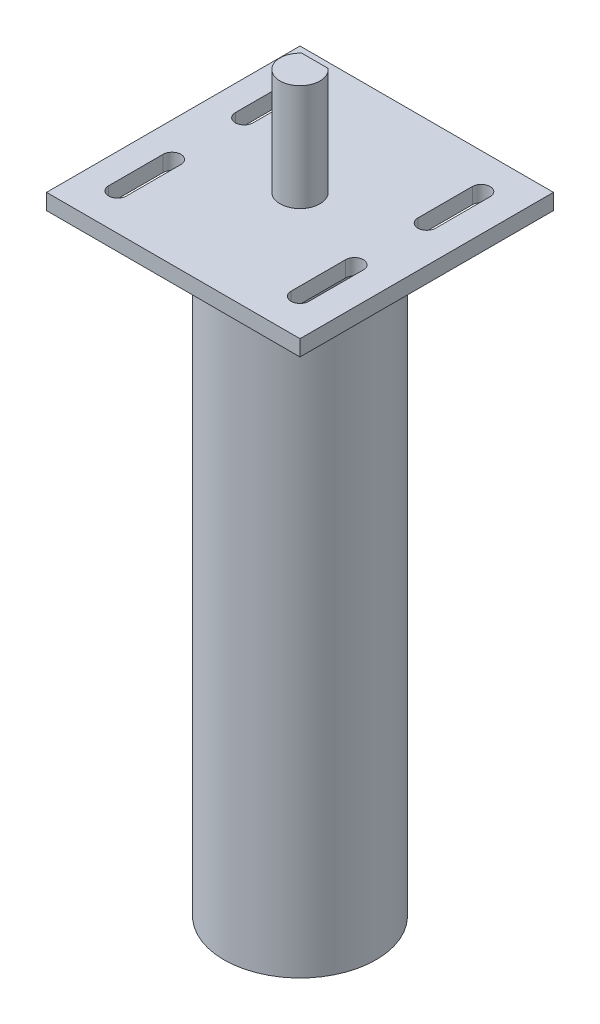
ISO-10303-21;
HEADER;
FILE_DESCRIPTION(('STEP AP214'),'2;1');
FILE_NAME('part.step','',(''),(''),'','','');
FILE_SCHEMA(('AUTOMOTIVE_DESIGN { 1 0 10303 214 1 1 1 1 }'));
ENDSEC;
DATA;
#1=APPLICATION_CONTEXT('core data for automotive mechanical design processes');
#2=APPLICATION_PROTOCOL_DEFINITION('international standard','automotive_design',2000,#1);
#3=PRODUCT_CONTEXT('',#1,'mechanical');
#4=PRODUCT('Part','Part','',(#3));
#5=PRODUCT_RELATED_PRODUCT_CATEGORY('part','',(#4));
#6=PRODUCT_DEFINITION_FORMATION('','',#4);
#7=PRODUCT_DEFINITION_CONTEXT('part definition',#1,'design');
#8=PRODUCT_DEFINITION('design','',#6,#7);
#9=PRODUCT_DEFINITION_SHAPE('','',#8);
#10=(LENGTH_UNIT() NAMED_UNIT(*) SI_UNIT(.MILLI.,.METRE.));
#11=(NAMED_UNIT(*) PLANE_ANGLE_UNIT() SI_UNIT($,.RADIAN.));
#12=(NAMED_UNIT(*) SI_UNIT($,.STERADIAN.) SOLID_ANGLE_UNIT());
#13=UNCERTAINTY_MEASURE_WITH_UNIT(LENGTH_MEASURE(1.E-05),#10,'distance_accuracy_value','');
#14=(GEOMETRIC_REPRESENTATION_CONTEXT(3) GLOBAL_UNCERTAINTY_ASSIGNED_CONTEXT((#13)) GLOBAL_UNIT_ASSIGNED_CONTEXT((#10,
#11,#12)) REPRESENTATION_CONTEXT('',''));
#15=CARTESIAN_POINT('',(0.,0.,0.));
#16=DIRECTION('',(0.,0.,1.));
#17=DIRECTION('',(1.,0.,0.));
#18=AXIS2_PLACEMENT_3D('',#15,#16,#17);
#19=CARTESIAN_POINT('',(0.,122.428,0.));
#20=DIRECTION('',(0.,-1.,0.));
#21=DIRECTION('',(0.,0.,-1.));
#22=AXIS2_PLACEMENT_3D('',#19,#20,#21);
#23=CYLINDRICAL_SURFACE('',#22,15.24);
#24=CARTESIAN_POINT('',(0.,122.428,0.));
#25=DIRECTION('',(0.,1.,0.));
#26=DIRECTION('',(0.,0.,1.));
#27=AXIS2_PLACEMENT_3D('',#24,#25,#26);
#28=CIRCLE('',#27,15.24);
#29=CARTESIAN_POINT('',(0.,122.428,15.24));
#30=VERTEX_POINT('',#29);
#31=EDGE_CURVE('E11',#30,#30,#28,.T.);
#32=ORIENTED_EDGE('',*,*,#31,.F.);
#33=EDGE_LOOP('',(#32));
#34=FACE_BOUND('',#33,.T.);
#35=CARTESIAN_POINT('',(0.,0.,0.));
#36=DIRECTION('',(0.,1.,0.));
#37=DIRECTION('',(0.,0.,1.));
#38=AXIS2_PLACEMENT_3D('',#35,#36,#37);
#39=CIRCLE('',#38,15.24);
#40=CARTESIAN_POINT('',(0.,0.,15.24));
#41=VERTEX_POINT('',#40);
#42=EDGE_CURVE('E37',#41,#41,#39,.T.);
#43=ORIENTED_EDGE('',*,*,#42,.T.);
#44=EDGE_LOOP('',(#43));
#45=FACE_BOUND('',#44,.T.);
#46=ADVANCED_FACE('F34',(#34,#45),#23,.T.);
#47=CARTESIAN_POINT('',(0.,0.,0.));
#48=DIRECTION('',(0.,1.,0.));
#49=DIRECTION('',(0.,0.,1.));
#50=AXIS2_PLACEMENT_3D('',#47,#48,#49);
#51=PLANE('',#50);
#52=ORIENTED_EDGE('',*,*,#42,.F.);
#53=EDGE_LOOP('',(#52));
#54=FACE_BOUND('',#53,.T.);
#55=ADVANCED_FACE('F355',(#54),#51,.F.);
#56=CARTESIAN_POINT('',(25.4,125.603,-25.4));
#57=DIRECTION('',(-1.,0.,0.));
#58=DIRECTION('',(0.,0.,1.));
#59=AXIS2_PLACEMENT_3D('',#56,#57,#58);
#60=PLANE('',#59);
#61=DIRECTION('',(0.,0.,-1.));
#62=VECTOR('',#61,1.);
#63=CARTESIAN_POINT('',(25.4,122.428,-25.4));
#64=LINE('',#63,#62);
#65=CARTESIAN_POINT('',(25.4,122.428,25.4));
#66=VERTEX_POINT('',#65);
#67=CARTESIAN_POINT('',(25.4,122.428,-25.4));
#68=VERTEX_POINT('',#67);
#69=EDGE_CURVE('E318',#66,#68,#64,.T.);
#70=ORIENTED_EDGE('',*,*,#69,.T.);
#71=DIRECTION('',(0.,-1.,0.));
#72=VECTOR('',#71,1.);
#73=CARTESIAN_POINT('',(25.4,125.603,-25.4));
#74=LINE('',#73,#72);
#75=CARTESIAN_POINT('',(25.4,125.603,-25.4));
#76=VERTEX_POINT('',#75);
#77=EDGE_CURVE('E347',#76,#68,#74,.T.);
#78=ORIENTED_EDGE('',*,*,#77,.F.);
#79=DIRECTION('',(0.,0.,-1.));
#80=VECTOR('',#79,1.);
#81=CARTESIAN_POINT('',(25.4,125.603,-25.4));
#82=LINE('',#81,#80);
#83=CARTESIAN_POINT('',(25.4,125.603,25.4));
#84=VERTEX_POINT('',#83);
#85=EDGE_CURVE('E321',#84,#76,#82,.T.);
#86=ORIENTED_EDGE('',*,*,#85,.F.);
#87=DIRECTION('',(0.,-1.,0.));
#88=VECTOR('',#87,1.);
#89=CARTESIAN_POINT('',(25.4,125.603,25.4));
#90=LINE('',#89,#88);
#91=EDGE_CURVE('E331',#84,#66,#90,.T.);
#92=ORIENTED_EDGE('',*,*,#91,.T.);
#93=EDGE_LOOP('',(#70,#78,#86,#92));
#94=FACE_BOUND('',#93,.T.);
#95=ADVANCED_FACE('F357',(#94),#60,.F.);
#96=CARTESIAN_POINT('',(-25.4,125.603,-25.4));
#97=DIRECTION('',(0.,0.,1.));
#98=DIRECTION('',(1.,0.,0.));
#99=AXIS2_PLACEMENT_3D('',#96,#97,#98);
#100=PLANE('',#99);
#101=DIRECTION('',(-1.,0.,0.));
#102=VECTOR('',#101,1.);
#103=CARTESIAN_POINT('',(-25.4,122.428,-25.4));
#104=LINE('',#103,#102);
#105=CARTESIAN_POINT('',(-25.4,122.428,-25.4));
#106=VERTEX_POINT('',#105);
#107=EDGE_CURVE('E334',#68,#106,#104,.T.);
#108=ORIENTED_EDGE('',*,*,#107,.T.);
#109=DIRECTION('',(0.,-1.,0.));
#110=VECTOR('',#109,1.);
#111=CARTESIAN_POINT('',(-25.4,125.603,-25.4));
#112=LINE('',#111,#110);
#113=CARTESIAN_POINT('',(-25.4,125.603,-25.4));
#114=VERTEX_POINT('',#113);
#115=EDGE_CURVE('E344',#114,#106,#112,.T.);
#116=ORIENTED_EDGE('',*,*,#115,.F.);
#117=DIRECTION('',(-1.,0.,0.));
#118=VECTOR('',#117,1.);
#119=CARTESIAN_POINT('',(-25.4,125.603,-25.4));
#120=LINE('',#119,#118);
#121=EDGE_CURVE('E324',#76,#114,#120,.T.);
#122=ORIENTED_EDGE('',*,*,#121,.F.);
#123=ORIENTED_EDGE('',*,*,#77,.T.);
#124=EDGE_LOOP('',(#108,#116,#122,#123));
#125=FACE_BOUND('',#124,.T.);
#126=ADVANCED_FACE('F362',(#125),#100,.F.);
#127=CARTESIAN_POINT('',(-25.4,125.603,-25.4));
#128=DIRECTION('',(1.,0.,0.));
#129=DIRECTION('',(0.,0.,-1.));
#130=AXIS2_PLACEMENT_3D('',#127,#128,#129);
#131=PLANE('',#130);
#132=DIRECTION('',(0.,0.,1.));
#133=VECTOR('',#132,1.);
#134=CARTESIAN_POINT('',(-25.4,122.428,-25.4));
#135=LINE('',#134,#133);
#136=CARTESIAN_POINT('',(-25.4,122.428,25.4));
#137=VERTEX_POINT('',#136);
#138=EDGE_CURVE('E336',#106,#137,#135,.T.);
#139=ORIENTED_EDGE('',*,*,#138,.T.);
#140=DIRECTION('',(0.,-1.,0.));
#141=VECTOR('',#140,1.);
#142=CARTESIAN_POINT('',(-25.4,125.603,25.4));
#143=LINE('',#142,#141);
#144=CARTESIAN_POINT('',(-25.4,125.603,25.4));
#145=VERTEX_POINT('',#144);
#146=EDGE_CURVE('E341',#145,#137,#143,.T.);
#147=ORIENTED_EDGE('',*,*,#146,.F.);
#148=DIRECTION('',(0.,0.,1.));
#149=VECTOR('',#148,1.);
#150=CARTESIAN_POINT('',(-25.4,125.603,-25.4));
#151=LINE('',#150,#149);
#152=EDGE_CURVE('E327',#114,#145,#151,.T.);
#153=ORIENTED_EDGE('',*,*,#152,.F.);
#154=ORIENTED_EDGE('',*,*,#115,.T.);
#155=EDGE_LOOP('',(#139,#147,#153,#154));
#156=FACE_BOUND('',#155,.T.);
#157=ADVANCED_FACE('F369',(#156),#131,.F.);
#158=CARTESIAN_POINT('',(-25.4,125.603,25.4));
#159=DIRECTION('',(0.,0.,-1.));
#160=DIRECTION('',(-1.,0.,0.));
#161=AXIS2_PLACEMENT_3D('',#158,#159,#160);
#162=PLANE('',#161);
#163=DIRECTION('',(1.,0.,0.));
#164=VECTOR('',#163,1.);
#165=CARTESIAN_POINT('',(-25.4,122.428,25.4));
#166=LINE('',#165,#164);
#167=EDGE_CURVE('E325',#137,#66,#166,.T.);
#168=ORIENTED_EDGE('',*,*,#167,.T.);
#169=ORIENTED_EDGE('',*,*,#91,.F.);
#170=DIRECTION('',(1.,0.,0.));
#171=VECTOR('',#170,1.);
#172=CARTESIAN_POINT('',(-25.4,125.603,25.4));
#173=LINE('',#172,#171);
#174=EDGE_CURVE('E329',#145,#84,#173,.T.);
#175=ORIENTED_EDGE('',*,*,#174,.F.);
#176=ORIENTED_EDGE('',*,*,#146,.T.);
#177=EDGE_LOOP('',(#168,#169,#175,#176));
#178=FACE_BOUND('',#177,.T.);
#179=ADVANCED_FACE('F372',(#178),#162,.F.);
#180=CARTESIAN_POINT('',(0.,125.603,0.));
#181=DIRECTION('',(0.,1.,0.));
#182=DIRECTION('',(0.,0.,1.));
#183=AXIS2_PLACEMENT_3D('',#180,#181,#182);
#184=PLANE('',#183);
#185=CARTESIAN_POINT('',(18.034,125.603,-18.288));
#186=DIRECTION('',(0.,1.,0.));
#187=DIRECTION('',(0.,0.,1.));
#188=AXIS2_PLACEMENT_3D('',#185,#186,#187);
#189=CIRCLE('',#188,1.778);
#190=CARTESIAN_POINT('',(19.812,125.603,-18.288));
#191=VERTEX_POINT('',#190);
#192=CARTESIAN_POINT('',(16.256,125.603,-18.288));
#193=VERTEX_POINT('',#192);
#194=EDGE_CURVE('E48',#191,#193,#189,.T.);
#195=ORIENTED_EDGE('',*,*,#194,.F.);
#196=DIRECTION('',(0.,0.,-1.));
#197=VECTOR('',#196,1.);
#198=CARTESIAN_POINT('',(19.812,125.603,-18.288));
#199=LINE('',#198,#197);
#200=CARTESIAN_POINT('',(19.812,125.603,-7.36599999999999));
#201=VERTEX_POINT('',#200);
#202=EDGE_CURVE('E266',#201,#191,#199,.T.);
#203=ORIENTED_EDGE('',*,*,#202,.F.);
#204=CARTESIAN_POINT('',(18.034,125.603,-7.36599999999999));
#205=DIRECTION('',(0.,1.,0.));
#206=DIRECTION('',(0.,0.,1.));
#207=AXIS2_PLACEMENT_3D('',#204,#205,#206);
#208=CIRCLE('',#207,1.778);
#209=CARTESIAN_POINT('',(16.256,125.603,-7.36599999999999));
#210=VERTEX_POINT('',#209);
#211=EDGE_CURVE('E263',#210,#201,#208,.T.);
#212=ORIENTED_EDGE('',*,*,#211,.F.);
#213=DIRECTION('',(0.,0.,1.));
#214=VECTOR('',#213,1.);
#215=CARTESIAN_POINT('',(16.256,125.603,-18.288));
#216=LINE('',#215,#214);
#217=EDGE_CURVE('E260',#193,#210,#216,.T.);
#218=ORIENTED_EDGE('',*,*,#217,.F.);
#219=EDGE_LOOP('',(#195,#203,#212,#218));
#220=FACE_BOUND('',#219,.T.);
#221=CARTESIAN_POINT('',(18.034,125.603,7.11200000000001));
#222=DIRECTION('',(0.,1.,0.));
#223=DIRECTION('',(0.,0.,1.));
#224=AXIS2_PLACEMENT_3D('',#221,#222,#223);
#225=CIRCLE('',#224,1.778);
#226=CARTESIAN_POINT('',(19.812,125.603,7.11200000000001));
#227=VERTEX_POINT('',#226);
#228=CARTESIAN_POINT('',(16.256,125.603,7.11200000000001));
#229=VERTEX_POINT('',#228);
#230=EDGE_CURVE('E56',#227,#229,#225,.T.);
#231=ORIENTED_EDGE('',*,*,#230,.F.);
#232=DIRECTION('',(0.,0.,-1.));
#233=VECTOR('',#232,1.);
#234=CARTESIAN_POINT('',(19.812,125.603,7.11200000000001));
#235=LINE('',#234,#233);
#236=CARTESIAN_POINT('',(19.812,125.603,18.034));
#237=VERTEX_POINT('',#236);
#238=EDGE_CURVE('E240',#237,#227,#235,.T.);
#239=ORIENTED_EDGE('',*,*,#238,.F.);
#240=CARTESIAN_POINT('',(18.034,125.603,18.034));
#241=DIRECTION('',(0.,1.,0.));
#242=DIRECTION('',(0.,0.,1.));
#243=AXIS2_PLACEMENT_3D('',#240,#241,#242);
#244=CIRCLE('',#243,1.778);
#245=CARTESIAN_POINT('',(16.256,125.603,18.034));
#246=VERTEX_POINT('',#245);
#247=EDGE_CURVE('E237',#246,#237,#244,.T.);
#248=ORIENTED_EDGE('',*,*,#247,.F.);
#249=DIRECTION('',(0.,0.,1.));
#250=VECTOR('',#249,1.);
#251=CARTESIAN_POINT('',(16.256,125.603,7.11200000000001));
#252=LINE('',#251,#250);
#253=EDGE_CURVE('E233',#229,#246,#252,.T.);
#254=ORIENTED_EDGE('',*,*,#253,.F.);
#255=EDGE_LOOP('',(#231,#239,#248,#254));
#256=FACE_BOUND('',#255,.T.);
#257=CARTESIAN_POINT('',(-18.542,125.603,7.112));
#258=DIRECTION('',(0.,1.,0.));
#259=DIRECTION('',(0.,0.,1.));
#260=AXIS2_PLACEMENT_3D('',#257,#258,#259);
#261=CIRCLE('',#260,1.778);
#262=CARTESIAN_POINT('',(-16.764,125.603,7.112));
#263=VERTEX_POINT('',#262);
#264=CARTESIAN_POINT('',(-20.32,125.603,7.112));
#265=VERTEX_POINT('',#264);
#266=EDGE_CURVE('E205',#263,#265,#261,.T.);
#267=ORIENTED_EDGE('',*,*,#266,.F.);
#268=DIRECTION('',(0.,0.,-1.));
#269=VECTOR('',#268,1.);
#270=CARTESIAN_POINT('',(-16.764,125.603,7.112));
#271=LINE('',#270,#269);
#272=CARTESIAN_POINT('',(-16.764,125.603,18.034));
#273=VERTEX_POINT('',#272);
#274=EDGE_CURVE('E210',#273,#263,#271,.T.);
#275=ORIENTED_EDGE('',*,*,#274,.F.);
#276=CARTESIAN_POINT('',(-18.542,125.603,18.034));
#277=DIRECTION('',(0.,1.,0.));
#278=DIRECTION('',(0.,0.,1.));
#279=AXIS2_PLACEMENT_3D('',#276,#277,#278);
#280=CIRCLE('',#279,1.778);
#281=CARTESIAN_POINT('',(-20.32,125.603,18.034));
#282=VERTEX_POINT('',#281);
#283=EDGE_CURVE('E189',#282,#273,#280,.T.);
#284=ORIENTED_EDGE('',*,*,#283,.F.);
#285=DIRECTION('',(0.,0.,1.));
#286=VECTOR('',#285,1.);
#287=CARTESIAN_POINT('',(-20.32,125.603,7.112));
#288=LINE('',#287,#286);
#289=EDGE_CURVE('E200',#265,#282,#288,.T.);
#290=ORIENTED_EDGE('',*,*,#289,.F.);
#291=EDGE_LOOP('',(#267,#275,#284,#290));
#292=FACE_BOUND('',#291,.T.);
#293=CARTESIAN_POINT('',(-18.542,125.603,-18.288));
#294=DIRECTION('',(0.,1.,0.));
#295=DIRECTION('',(0.,0.,1.));
#296=AXIS2_PLACEMENT_3D('',#293,#294,#295);
#297=CIRCLE('',#296,1.778);
#298=CARTESIAN_POINT('',(-16.764,125.603,-18.288));
#299=VERTEX_POINT('',#298);
#300=CARTESIAN_POINT('',(-20.32,125.603,-18.288));
#301=VERTEX_POINT('',#300);
#302=EDGE_CURVE('E221',#299,#301,#297,.T.);
#303=ORIENTED_EDGE('',*,*,#302,.F.);
#304=DIRECTION('',(0.,0.,-1.));
#305=VECTOR('',#304,1.);
#306=CARTESIAN_POINT('',(-16.764,125.603,-18.288));
#307=LINE('',#306,#305);
#308=CARTESIAN_POINT('',(-16.764,125.603,-7.366));
#309=VERTEX_POINT('',#308);
#310=EDGE_CURVE('E293',#309,#299,#307,.T.);
#311=ORIENTED_EDGE('',*,*,#310,.F.);
#312=CARTESIAN_POINT('',(-18.542,125.603,-7.366));
#313=DIRECTION('',(0.,1.,0.));
#314=DIRECTION('',(0.,0.,1.));
#315=AXIS2_PLACEMENT_3D('',#312,#313,#314);
#316=CIRCLE('',#315,1.778);
#317=CARTESIAN_POINT('',(-20.32,125.603,-7.366));
#318=VERTEX_POINT('',#317);
#319=EDGE_CURVE('E290',#318,#309,#316,.T.);
#320=ORIENTED_EDGE('',*,*,#319,.F.);
#321=DIRECTION('',(0.,0.,1.));
#322=VECTOR('',#321,1.);
#323=CARTESIAN_POINT('',(-20.32,125.603,-18.288));
#324=LINE('',#323,#322);
#325=EDGE_CURVE('E287',#301,#318,#324,.T.);
#326=ORIENTED_EDGE('',*,*,#325,.F.);
#327=EDGE_LOOP('',(#303,#311,#320,#326));
#328=FACE_BOUND('',#327,.T.);
#329=CARTESIAN_POINT('',(0.,125.603,0.));
#330=DIRECTION('',(0.,1.,0.));
#331=DIRECTION('',(0.,0.,1.));
#332=AXIS2_PLACEMENT_3D('',#329,#330,#331);
#333=CIRCLE('',#332,4.);
#334=CARTESIAN_POINT('',(-2.64575131106459,125.603,-3.));
#335=VERTEX_POINT('',#334);
#336=CARTESIAN_POINT('',(2.64575131106459,125.603,-3.));
#337=VERTEX_POINT('',#336);
#338=EDGE_CURVE('E314',#335,#337,#333,.T.);
#339=ORIENTED_EDGE('',*,*,#338,.F.);
#340=DIRECTION('',(-1.,0.,0.));
#341=VECTOR('',#340,1.);
#342=CARTESIAN_POINT('',(2.64575131106459,125.603,-3.));
#343=LINE('',#342,#341);
#344=EDGE_CURVE('E311',#337,#335,#343,.T.);
#345=ORIENTED_EDGE('',*,*,#344,.F.);
#346=EDGE_LOOP('',(#339,#345));
#347=FACE_BOUND('',#346,.T.);
#348=ORIENTED_EDGE('',*,*,#85,.T.);
#349=ORIENTED_EDGE('',*,*,#121,.T.);
#350=ORIENTED_EDGE('',*,*,#152,.T.);
#351=ORIENTED_EDGE('',*,*,#174,.T.);
#352=EDGE_LOOP('',(#348,#349,#350,#351));
#353=FACE_BOUND('',#352,.T.);
#354=ADVANCED_FACE('F207',(#220,#256,#292,#328,#347,#353),#184,.T.);
#355=CARTESIAN_POINT('',(0.,122.428,0.));
#356=DIRECTION('',(0.,1.,0.));
#357=DIRECTION('',(0.,0.,1.));
#358=AXIS2_PLACEMENT_3D('',#355,#356,#357);
#359=PLANE('',#358);
#360=DIRECTION('',(0.,0.,1.));
#361=VECTOR('',#360,1.);
#362=CARTESIAN_POINT('',(19.812,122.428,-18.288));
#363=LINE('',#362,#361);
#364=CARTESIAN_POINT('',(19.812,122.428,-18.288));
#365=VERTEX_POINT('',#364);
#366=CARTESIAN_POINT('',(19.812,122.428,-7.36599999999999));
#367=VERTEX_POINT('',#366);
#368=EDGE_CURVE('E254',#365,#367,#363,.T.);
#369=ORIENTED_EDGE('',*,*,#368,.F.);
#370=CARTESIAN_POINT('',(18.034,122.428,-18.288));
#371=DIRECTION('',(0.,1.,0.));
#372=DIRECTION('',(0.,0.,1.));
#373=AXIS2_PLACEMENT_3D('',#370,#371,#372);
#374=CIRCLE('',#373,1.778);
#375=CARTESIAN_POINT('',(16.256,122.428,-18.288));
#376=VERTEX_POINT('',#375);
#377=EDGE_CURVE('E257',#376,#365,#374,.F.);
#378=ORIENTED_EDGE('',*,*,#377,.F.);
#379=DIRECTION('',(0.,0.,-1.));
#380=VECTOR('',#379,1.);
#381=CARTESIAN_POINT('',(16.256,122.428,-18.288));
#382=LINE('',#381,#380);
#383=CARTESIAN_POINT('',(16.256,122.428,-7.36599999999999));
#384=VERTEX_POINT('',#383);
#385=EDGE_CURVE('E234',#384,#376,#382,.T.);
#386=ORIENTED_EDGE('',*,*,#385,.F.);
#387=CARTESIAN_POINT('',(18.034,122.428,-7.36599999999999));
#388=DIRECTION('',(0.,1.,0.));
#389=DIRECTION('',(0.,0.,1.));
#390=AXIS2_PLACEMENT_3D('',#387,#388,#389);
#391=CIRCLE('',#390,1.778);
#392=EDGE_CURVE('E251',#367,#384,#391,.F.);
#393=ORIENTED_EDGE('',*,*,#392,.F.);
#394=EDGE_LOOP('',(#369,#378,#386,#393));
#395=FACE_BOUND('',#394,.T.);
#396=DIRECTION('',(0.,0.,1.));
#397=VECTOR('',#396,1.);
#398=CARTESIAN_POINT('',(19.812,122.428,7.11200000000001));
#399=LINE('',#398,#397);
#400=CARTESIAN_POINT('',(19.812,122.428,7.11200000000001));
#401=VERTEX_POINT('',#400);
#402=CARTESIAN_POINT('',(19.812,122.428,18.034));
#403=VERTEX_POINT('',#402);
#404=EDGE_CURVE('E226',#401,#403,#399,.T.);
#405=ORIENTED_EDGE('',*,*,#404,.F.);
#406=CARTESIAN_POINT('',(18.034,122.428,7.11200000000001));
#407=DIRECTION('',(0.,1.,0.));
#408=DIRECTION('',(0.,0.,1.));
#409=AXIS2_PLACEMENT_3D('',#406,#407,#408);
#410=CIRCLE('',#409,1.778);
#411=CARTESIAN_POINT('',(16.256,122.428,7.11200000000001));
#412=VERTEX_POINT('',#411);
#413=EDGE_CURVE('E229',#412,#401,#410,.F.);
#414=ORIENTED_EDGE('',*,*,#413,.F.);
#415=DIRECTION('',(0.,0.,-1.));
#416=VECTOR('',#415,1.);
#417=CARTESIAN_POINT('',(16.256,122.428,7.11200000000001));
#418=LINE('',#417,#416);
#419=CARTESIAN_POINT('',(16.256,122.428,18.034));
#420=VERTEX_POINT('',#419);
#421=EDGE_CURVE('E231',#420,#412,#418,.T.);
#422=ORIENTED_EDGE('',*,*,#421,.F.);
#423=CARTESIAN_POINT('',(18.034,122.428,18.034));
#424=DIRECTION('',(0.,1.,0.));
#425=DIRECTION('',(0.,0.,1.));
#426=AXIS2_PLACEMENT_3D('',#423,#424,#425);
#427=CIRCLE('',#426,1.778);
#428=EDGE_CURVE('E223',#403,#420,#427,.F.);
#429=ORIENTED_EDGE('',*,*,#428,.F.);
#430=EDGE_LOOP('',(#405,#414,#422,#429));
#431=FACE_BOUND('',#430,.T.);
#432=DIRECTION('',(0.,0.,1.));
#433=VECTOR('',#432,1.);
#434=CARTESIAN_POINT('',(-16.764,122.428,7.112));
#435=LINE('',#434,#433);
#436=CARTESIAN_POINT('',(-16.764,122.428,7.112));
#437=VERTEX_POINT('',#436);
#438=CARTESIAN_POINT('',(-16.764,122.428,18.034));
#439=VERTEX_POINT('',#438);
#440=EDGE_CURVE('E457',#437,#439,#435,.T.);
#441=ORIENTED_EDGE('',*,*,#440,.F.);
#442=CARTESIAN_POINT('',(-18.542,122.428,7.112));
#443=DIRECTION('',(0.,1.,0.));
#444=DIRECTION('',(0.,0.,1.));
#445=AXIS2_PLACEMENT_3D('',#442,#443,#444);
#446=CIRCLE('',#445,1.778);
#447=CARTESIAN_POINT('',(-20.32,122.428,7.112));
#448=VERTEX_POINT('',#447);
#449=EDGE_CURVE('E222',#448,#437,#446,.F.);
#450=ORIENTED_EDGE('',*,*,#449,.F.);
#451=DIRECTION('',(0.,0.,-1.));
#452=VECTOR('',#451,1.);
#453=CARTESIAN_POINT('',(-20.32,122.428,7.112));
#454=LINE('',#453,#452);
#455=CARTESIAN_POINT('',(-20.32,122.428,18.034));
#456=VERTEX_POINT('',#455);
#457=EDGE_CURVE('E219',#456,#448,#454,.T.);
#458=ORIENTED_EDGE('',*,*,#457,.F.);
#459=CARTESIAN_POINT('',(-18.542,122.428,18.034));
#460=DIRECTION('',(0.,1.,0.));
#461=DIRECTION('',(0.,0.,1.));
#462=AXIS2_PLACEMENT_3D('',#459,#460,#461);
#463=CIRCLE('',#462,1.778);
#464=EDGE_CURVE('E192',#439,#456,#463,.F.);
#465=ORIENTED_EDGE('',*,*,#464,.F.);
#466=EDGE_LOOP('',(#441,#450,#458,#465));
#467=FACE_BOUND('',#466,.T.);
#468=DIRECTION('',(0.,0.,1.));
#469=VECTOR('',#468,1.);
#470=CARTESIAN_POINT('',(-16.764,122.428,-18.288));
#471=LINE('',#470,#469);
#472=CARTESIAN_POINT('',(-16.764,122.428,-18.288));
#473=VERTEX_POINT('',#472);
#474=CARTESIAN_POINT('',(-16.764,122.428,-7.366));
#475=VERTEX_POINT('',#474);
#476=EDGE_CURVE('E280',#473,#475,#471,.T.);
#477=ORIENTED_EDGE('',*,*,#476,.F.);
#478=CARTESIAN_POINT('',(-18.542,122.428,-18.288));
#479=DIRECTION('',(0.,1.,0.));
#480=DIRECTION('',(0.,0.,1.));
#481=AXIS2_PLACEMENT_3D('',#478,#479,#480);
#482=CIRCLE('',#481,1.778);
#483=CARTESIAN_POINT('',(-20.32,122.428,-18.288));
#484=VERTEX_POINT('',#483);
#485=EDGE_CURVE('E283',#484,#473,#482,.F.);
#486=ORIENTED_EDGE('',*,*,#485,.F.);
#487=DIRECTION('',(0.,0.,-1.));
#488=VECTOR('',#487,1.);
#489=CARTESIAN_POINT('',(-20.32,122.428,-18.288));
#490=LINE('',#489,#488);
#491=CARTESIAN_POINT('',(-20.32,122.428,-7.366));
#492=VERTEX_POINT('',#491);
#493=EDGE_CURVE('E285',#492,#484,#490,.T.);
#494=ORIENTED_EDGE('',*,*,#493,.F.);
#495=CARTESIAN_POINT('',(-18.542,122.428,-7.366));
#496=DIRECTION('',(0.,1.,0.));
#497=DIRECTION('',(0.,0.,1.));
#498=AXIS2_PLACEMENT_3D('',#495,#496,#497);
#499=CIRCLE('',#498,1.778);
#500=EDGE_CURVE('E277',#475,#492,#499,.F.);
#501=ORIENTED_EDGE('',*,*,#500,.F.);
#502=EDGE_LOOP('',(#477,#486,#494,#501));
#503=FACE_BOUND('',#502,.T.);
#504=ORIENTED_EDGE('',*,*,#31,.T.);
#505=EDGE_LOOP('',(#504));
#506=FACE_BOUND('',#505,.T.);
#507=ORIENTED_EDGE('',*,*,#69,.F.);
#508=ORIENTED_EDGE('',*,*,#167,.F.);
#509=ORIENTED_EDGE('',*,*,#138,.F.);
#510=ORIENTED_EDGE('',*,*,#107,.F.);
#511=EDGE_LOOP('',(#507,#508,#509,#510));
#512=FACE_BOUND('',#511,.T.);
#513=ADVANCED_FACE('F377',(#395,#431,#467,#503,#506,#512),#359,.F.);
#514=CARTESIAN_POINT('',(0.,146.939,0.));
#515=DIRECTION('',(0.,-1.,0.));
#516=DIRECTION('',(0.,0.,-1.));
#517=AXIS2_PLACEMENT_3D('',#514,#515,#516);
#518=CYLINDRICAL_SURFACE('',#517,4.);
#519=CARTESIAN_POINT('',(0.,146.939,0.));
#520=DIRECTION('',(0.,1.,0.));
#521=DIRECTION('',(0.,0.,1.));
#522=AXIS2_PLACEMENT_3D('',#519,#520,#521);
#523=CIRCLE('',#522,4.);
#524=CARTESIAN_POINT('',(-2.64575131106459,146.939,-3.));
#525=VERTEX_POINT('',#524);
#526=CARTESIAN_POINT('',(2.64575131106459,146.939,-3.));
#527=VERTEX_POINT('',#526);
#528=EDGE_CURVE('E315',#525,#527,#523,.T.);
#529=ORIENTED_EDGE('',*,*,#528,.F.);
#530=DIRECTION('',(0.,1.,0.));
#531=VECTOR('',#530,1.);
#532=CARTESIAN_POINT('',(-2.64575131106459,120.217835192866,-3.));
#533=LINE('',#532,#531);
#534=EDGE_CURVE('E307',#335,#525,#533,.T.);
#535=ORIENTED_EDGE('',*,*,#534,.F.);
#536=ORIENTED_EDGE('',*,*,#338,.T.);
#537=DIRECTION('',(0.,1.,0.));
#538=VECTOR('',#537,1.);
#539=CARTESIAN_POINT('',(2.64575131106459,120.217835192866,-3.));
#540=LINE('',#539,#538);
#541=EDGE_CURVE('E308',#337,#527,#540,.T.);
#542=ORIENTED_EDGE('',*,*,#541,.T.);
#543=EDGE_LOOP('',(#529,#535,#536,#542));
#544=FACE_BOUND('',#543,.T.);
#545=ADVANCED_FACE('F380',(#544),#518,.T.);
#546=CARTESIAN_POINT('',(0.,146.939,0.));
#547=DIRECTION('',(0.,1.,0.));
#548=DIRECTION('',(0.,0.,1.));
#549=AXIS2_PLACEMENT_3D('',#546,#547,#548);
#550=PLANE('',#549);
#551=DIRECTION('',(1.,0.,0.));
#552=VECTOR('',#551,1.);
#553=CARTESIAN_POINT('',(2.64575131106459,146.939,-3.));
#554=LINE('',#553,#552);
#555=EDGE_CURVE('E305',#525,#527,#554,.T.);
#556=ORIENTED_EDGE('',*,*,#555,.F.);
#557=ORIENTED_EDGE('',*,*,#528,.T.);
#558=EDGE_LOOP('',(#556,#557));
#559=FACE_BOUND('',#558,.T.);
#560=ADVANCED_FACE('F387',(#559),#550,.T.);
#561=CARTESIAN_POINT('',(2.64575131106459,120.217835192866,-3.));
#562=DIRECTION('',(0.,0.,1.));
#563=DIRECTION('',(1.,0.,0.));
#564=AXIS2_PLACEMENT_3D('',#561,#562,#563);
#565=PLANE('',#564);
#566=ORIENTED_EDGE('',*,*,#344,.T.);
#567=ORIENTED_EDGE('',*,*,#534,.T.);
#568=ORIENTED_EDGE('',*,*,#555,.T.);
#569=ORIENTED_EDGE('',*,*,#541,.F.);
#570=EDGE_LOOP('',(#566,#567,#568,#569));
#571=FACE_BOUND('',#570,.T.);
#572=ADVANCED_FACE('F391',(#571),#565,.F.);
#573=CARTESIAN_POINT('',(-18.542,107.519692919718,-18.288));
#574=DIRECTION('',(0.,1.,0.));
#575=DIRECTION('',(0.,0.,1.));
#576=AXIS2_PLACEMENT_3D('',#573,#574,#575);
#577=CYLINDRICAL_SURFACE('',#576,1.778);
#578=ORIENTED_EDGE('',*,*,#485,.T.);
#579=DIRECTION('',(0.,1.,0.));
#580=VECTOR('',#579,1.);
#581=CARTESIAN_POINT('',(-16.764,107.519692919718,-18.288));
#582=LINE('',#581,#580);
#583=EDGE_CURVE('E281',#473,#299,#582,.T.);
#584=ORIENTED_EDGE('',*,*,#583,.T.);
#585=ORIENTED_EDGE('',*,*,#302,.T.);
#586=DIRECTION('',(0.,1.,0.));
#587=VECTOR('',#586,1.);
#588=CARTESIAN_POINT('',(-20.32,107.519692919718,-18.288));
#589=LINE('',#588,#587);
#590=EDGE_CURVE('E296',#484,#301,#589,.T.);
#591=ORIENTED_EDGE('',*,*,#590,.F.);
#592=EDGE_LOOP('',(#578,#584,#585,#591));
#593=FACE_BOUND('',#592,.T.);
#594=ADVANCED_FACE('F395',(#593),#577,.F.);
#595=CARTESIAN_POINT('',(-16.764,107.519692919718,-18.288));
#596=DIRECTION('',(1.,0.,0.));
#597=DIRECTION('',(0.,0.,-1.));
#598=AXIS2_PLACEMENT_3D('',#595,#596,#597);
#599=PLANE('',#598);
#600=ORIENTED_EDGE('',*,*,#476,.T.);
#601=DIRECTION('',(0.,1.,0.));
#602=VECTOR('',#601,1.);
#603=CARTESIAN_POINT('',(-16.764,107.519692919718,-7.366));
#604=LINE('',#603,#602);
#605=EDGE_CURVE('E298',#475,#309,#604,.T.);
#606=ORIENTED_EDGE('',*,*,#605,.T.);
#607=ORIENTED_EDGE('',*,*,#310,.T.);
#608=ORIENTED_EDGE('',*,*,#583,.F.);
#609=EDGE_LOOP('',(#600,#606,#607,#608));
#610=FACE_BOUND('',#609,.T.);
#611=ADVANCED_FACE('F399',(#610),#599,.F.);
#612=CARTESIAN_POINT('',(-18.542,107.519692919718,-7.366));
#613=DIRECTION('',(0.,1.,0.));
#614=DIRECTION('',(0.,0.,1.));
#615=AXIS2_PLACEMENT_3D('',#612,#613,#614);
#616=CYLINDRICAL_SURFACE('',#615,1.778);
#617=ORIENTED_EDGE('',*,*,#500,.T.);
#618=DIRECTION('',(0.,1.,0.));
#619=VECTOR('',#618,1.);
#620=CARTESIAN_POINT('',(-20.32,107.519692919718,-7.366));
#621=LINE('',#620,#619);
#622=EDGE_CURVE('E300',#492,#318,#621,.T.);
#623=ORIENTED_EDGE('',*,*,#622,.T.);
#624=ORIENTED_EDGE('',*,*,#319,.T.);
#625=ORIENTED_EDGE('',*,*,#605,.F.);
#626=EDGE_LOOP('',(#617,#623,#624,#625));
#627=FACE_BOUND('',#626,.T.);
#628=ADVANCED_FACE('F405',(#627),#616,.F.);
#629=CARTESIAN_POINT('',(-20.32,107.519692919718,-18.288));
#630=DIRECTION('',(-1.,0.,0.));
#631=DIRECTION('',(0.,0.,1.));
#632=AXIS2_PLACEMENT_3D('',#629,#630,#631);
#633=PLANE('',#632);
#634=ORIENTED_EDGE('',*,*,#493,.T.);
#635=ORIENTED_EDGE('',*,*,#590,.T.);
#636=ORIENTED_EDGE('',*,*,#325,.T.);
#637=ORIENTED_EDGE('',*,*,#622,.F.);
#638=EDGE_LOOP('',(#634,#635,#636,#637));
#639=FACE_BOUND('',#638,.T.);
#640=ADVANCED_FACE('F401',(#639),#633,.F.);
#641=CARTESIAN_POINT('',(-18.542,107.519692919718,7.112));
#642=DIRECTION('',(0.,1.,0.));
#643=DIRECTION('',(0.,0.,1.));
#644=AXIS2_PLACEMENT_3D('',#641,#642,#643);
#645=CYLINDRICAL_SURFACE('',#644,1.778);
#646=ORIENTED_EDGE('',*,*,#449,.T.);
#647=DIRECTION('',(0.,1.,0.));
#648=VECTOR('',#647,1.);
#649=CARTESIAN_POINT('',(-16.764,107.519692919718,7.112));
#650=LINE('',#649,#648);
#651=EDGE_CURVE('E215',#437,#263,#650,.T.);
#652=ORIENTED_EDGE('',*,*,#651,.T.);
#653=ORIENTED_EDGE('',*,*,#266,.T.);
#654=DIRECTION('',(0.,1.,0.));
#655=VECTOR('',#654,1.);
#656=CARTESIAN_POINT('',(-20.32,107.519692919718,7.112));
#657=LINE('',#656,#655);
#658=EDGE_CURVE('E196',#448,#265,#657,.T.);
#659=ORIENTED_EDGE('',*,*,#658,.F.);
#660=EDGE_LOOP('',(#646,#652,#653,#659));
#661=FACE_BOUND('',#660,.T.);
#662=ADVANCED_FACE('F404',(#661),#645,.F.);
#663=CARTESIAN_POINT('',(-16.764,107.519692919718,7.112));
#664=DIRECTION('',(1.,0.,0.));
#665=DIRECTION('',(0.,0.,-1.));
#666=AXIS2_PLACEMENT_3D('',#663,#664,#665);
#667=PLANE('',#666);
#668=ORIENTED_EDGE('',*,*,#440,.T.);
#669=DIRECTION('',(0.,1.,0.));
#670=VECTOR('',#669,1.);
#671=CARTESIAN_POINT('',(-16.764,107.519692919718,18.034));
#672=LINE('',#671,#670);
#673=EDGE_CURVE('E195',#439,#273,#672,.T.);
#674=ORIENTED_EDGE('',*,*,#673,.T.);
#675=ORIENTED_EDGE('',*,*,#274,.T.);
#676=ORIENTED_EDGE('',*,*,#651,.F.);
#677=EDGE_LOOP('',(#668,#674,#675,#676));
#678=FACE_BOUND('',#677,.T.);
#679=ADVANCED_FACE('F445',(#678),#667,.F.);
#680=CARTESIAN_POINT('',(-18.542,107.519692919718,18.034));
#681=DIRECTION('',(0.,1.,0.));
#682=DIRECTION('',(0.,0.,1.));
#683=AXIS2_PLACEMENT_3D('',#680,#681,#682);
#684=CYLINDRICAL_SURFACE('',#683,1.778);
#685=ORIENTED_EDGE('',*,*,#464,.T.);
#686=DIRECTION('',(0.,1.,0.));
#687=VECTOR('',#686,1.);
#688=CARTESIAN_POINT('',(-20.32,107.519692919718,18.034));
#689=LINE('',#688,#687);
#690=EDGE_CURVE('E184',#456,#282,#689,.T.);
#691=ORIENTED_EDGE('',*,*,#690,.T.);
#692=ORIENTED_EDGE('',*,*,#283,.T.);
#693=ORIENTED_EDGE('',*,*,#673,.F.);
#694=EDGE_LOOP('',(#685,#691,#692,#693));
#695=FACE_BOUND('',#694,.T.);
#696=ADVANCED_FACE('F186',(#695),#684,.F.);
#697=CARTESIAN_POINT('',(-20.32,107.519692919718,7.112));
#698=DIRECTION('',(-1.,0.,0.));
#699=DIRECTION('',(0.,0.,1.));
#700=AXIS2_PLACEMENT_3D('',#697,#698,#699);
#701=PLANE('',#700);
#702=ORIENTED_EDGE('',*,*,#457,.T.);
#703=ORIENTED_EDGE('',*,*,#658,.T.);
#704=ORIENTED_EDGE('',*,*,#289,.T.);
#705=ORIENTED_EDGE('',*,*,#690,.F.);
#706=EDGE_LOOP('',(#702,#703,#704,#705));
#707=FACE_BOUND('',#706,.T.);
#708=ADVANCED_FACE('F201',(#707),#701,.F.);
#709=CARTESIAN_POINT('',(18.034,107.519692919718,7.11200000000001));
#710=DIRECTION('',(0.,1.,0.));
#711=DIRECTION('',(0.,0.,1.));
#712=AXIS2_PLACEMENT_3D('',#709,#710,#711);
#713=CYLINDRICAL_SURFACE('',#712,1.778);
#714=ORIENTED_EDGE('',*,*,#413,.T.);
#715=DIRECTION('',(0.,1.,0.));
#716=VECTOR('',#715,1.);
#717=CARTESIAN_POINT('',(19.812,107.519692919718,7.11200000000001));
#718=LINE('',#717,#716);
#719=EDGE_CURVE('E227',#401,#227,#718,.T.);
#720=ORIENTED_EDGE('',*,*,#719,.T.);
#721=ORIENTED_EDGE('',*,*,#230,.T.);
#722=DIRECTION('',(0.,1.,0.));
#723=VECTOR('',#722,1.);
#724=CARTESIAN_POINT('',(16.256,107.519692919718,7.11200000000001));
#725=LINE('',#724,#723);
#726=EDGE_CURVE('E243',#412,#229,#725,.T.);
#727=ORIENTED_EDGE('',*,*,#726,.F.);
#728=EDGE_LOOP('',(#714,#720,#721,#727));
#729=FACE_BOUND('',#728,.T.);
#730=ADVANCED_FACE('F429',(#729),#713,.F.);
#731=CARTESIAN_POINT('',(19.812,107.519692919718,7.11200000000001));
#732=DIRECTION('',(1.,0.,0.));
#733=DIRECTION('',(0.,0.,-1.));
#734=AXIS2_PLACEMENT_3D('',#731,#732,#733);
#735=PLANE('',#734);
#736=ORIENTED_EDGE('',*,*,#404,.T.);
#737=DIRECTION('',(0.,1.,0.));
#738=VECTOR('',#737,1.);
#739=CARTESIAN_POINT('',(19.812,107.519692919718,18.034));
#740=LINE('',#739,#738);
#741=EDGE_CURVE('E245',#403,#237,#740,.T.);
#742=ORIENTED_EDGE('',*,*,#741,.T.);
#743=ORIENTED_EDGE('',*,*,#238,.T.);
#744=ORIENTED_EDGE('',*,*,#719,.F.);
#745=EDGE_LOOP('',(#736,#742,#743,#744));
#746=FACE_BOUND('',#745,.T.);
#747=ADVANCED_FACE('F432',(#746),#735,.F.);
#748=CARTESIAN_POINT('',(18.034,107.519692919718,18.034));
#749=DIRECTION('',(0.,1.,0.));
#750=DIRECTION('',(0.,0.,1.));
#751=AXIS2_PLACEMENT_3D('',#748,#749,#750);
#752=CYLINDRICAL_SURFACE('',#751,1.778);
#753=ORIENTED_EDGE('',*,*,#428,.T.);
#754=DIRECTION('',(0.,1.,0.));
#755=VECTOR('',#754,1.);
#756=CARTESIAN_POINT('',(16.256,107.519692919718,18.034));
#757=LINE('',#756,#755);
#758=EDGE_CURVE('E247',#420,#246,#757,.T.);
#759=ORIENTED_EDGE('',*,*,#758,.T.);
#760=ORIENTED_EDGE('',*,*,#247,.T.);
#761=ORIENTED_EDGE('',*,*,#741,.F.);
#762=EDGE_LOOP('',(#753,#759,#760,#761));
#763=FACE_BOUND('',#762,.T.);
#764=ADVANCED_FACE('F435',(#763),#752,.F.);
#765=CARTESIAN_POINT('',(16.256,107.519692919718,7.11200000000001));
#766=DIRECTION('',(-1.,0.,0.));
#767=DIRECTION('',(0.,0.,1.));
#768=AXIS2_PLACEMENT_3D('',#765,#766,#767);
#769=PLANE('',#768);
#770=ORIENTED_EDGE('',*,*,#421,.T.);
#771=ORIENTED_EDGE('',*,*,#726,.T.);
#772=ORIENTED_EDGE('',*,*,#253,.T.);
#773=ORIENTED_EDGE('',*,*,#758,.F.);
#774=EDGE_LOOP('',(#770,#771,#772,#773));
#775=FACE_BOUND('',#774,.T.);
#776=ADVANCED_FACE('F417',(#775),#769,.F.);
#777=CARTESIAN_POINT('',(18.034,107.519692919718,-18.288));
#778=DIRECTION('',(0.,1.,0.));
#779=DIRECTION('',(0.,0.,1.));
#780=AXIS2_PLACEMENT_3D('',#777,#778,#779);
#781=CYLINDRICAL_SURFACE('',#780,1.778);
#782=ORIENTED_EDGE('',*,*,#377,.T.);
#783=DIRECTION('',(0.,1.,0.));
#784=VECTOR('',#783,1.);
#785=CARTESIAN_POINT('',(19.812,107.519692919718,-18.288));
#786=LINE('',#785,#784);
#787=EDGE_CURVE('E255',#365,#191,#786,.T.);
#788=ORIENTED_EDGE('',*,*,#787,.T.);
#789=ORIENTED_EDGE('',*,*,#194,.T.);
#790=DIRECTION('',(0.,1.,0.));
#791=VECTOR('',#790,1.);
#792=CARTESIAN_POINT('',(16.256,107.519692919718,-18.288));
#793=LINE('',#792,#791);
#794=EDGE_CURVE('E269',#376,#193,#793,.T.);
#795=ORIENTED_EDGE('',*,*,#794,.F.);
#796=EDGE_LOOP('',(#782,#788,#789,#795));
#797=FACE_BOUND('',#796,.T.);
#798=ADVANCED_FACE('F413',(#797),#781,.F.);
#799=CARTESIAN_POINT('',(19.812,107.519692919718,-18.288));
#800=DIRECTION('',(1.,0.,0.));
#801=DIRECTION('',(0.,0.,-1.));
#802=AXIS2_PLACEMENT_3D('',#799,#800,#801);
#803=PLANE('',#802);
#804=ORIENTED_EDGE('',*,*,#368,.T.);
#805=DIRECTION('',(0.,1.,0.));
#806=VECTOR('',#805,1.);
#807=CARTESIAN_POINT('',(19.812,107.519692919718,-7.36599999999999));
#808=LINE('',#807,#806);
#809=EDGE_CURVE('E271',#367,#201,#808,.T.);
#810=ORIENTED_EDGE('',*,*,#809,.T.);
#811=ORIENTED_EDGE('',*,*,#202,.T.);
#812=ORIENTED_EDGE('',*,*,#787,.F.);
#813=EDGE_LOOP('',(#804,#810,#811,#812));
#814=FACE_BOUND('',#813,.T.);
#815=ADVANCED_FACE('F416',(#814),#803,.F.);
#816=CARTESIAN_POINT('',(18.034,107.519692919718,-7.36599999999999));
#817=DIRECTION('',(0.,1.,0.));
#818=DIRECTION('',(0.,0.,1.));
#819=AXIS2_PLACEMENT_3D('',#816,#817,#818);
#820=CYLINDRICAL_SURFACE('',#819,1.778);
#821=ORIENTED_EDGE('',*,*,#392,.T.);
#822=DIRECTION('',(0.,1.,0.));
#823=VECTOR('',#822,1.);
#824=CARTESIAN_POINT('',(16.256,107.519692919718,-7.36599999999999));
#825=LINE('',#824,#823);
#826=EDGE_CURVE('E273',#384,#210,#825,.T.);
#827=ORIENTED_EDGE('',*,*,#826,.T.);
#828=ORIENTED_EDGE('',*,*,#211,.T.);
#829=ORIENTED_EDGE('',*,*,#809,.F.);
#830=EDGE_LOOP('',(#821,#827,#828,#829));
#831=FACE_BOUND('',#830,.T.);
#832=ADVANCED_FACE('F421',(#831),#820,.F.);
#833=CARTESIAN_POINT('',(16.256,107.519692919718,-18.288));
#834=DIRECTION('',(-1.,0.,0.));
#835=DIRECTION('',(0.,0.,1.));
#836=AXIS2_PLACEMENT_3D('',#833,#834,#835);
#837=PLANE('',#836);
#838=ORIENTED_EDGE('',*,*,#385,.T.);
#839=ORIENTED_EDGE('',*,*,#794,.T.);
#840=ORIENTED_EDGE('',*,*,#217,.T.);
#841=ORIENTED_EDGE('',*,*,#826,.F.);
#842=EDGE_LOOP('',(#838,#839,#840,#841));
#843=FACE_BOUND('',#842,.T.);
#844=ADVANCED_FACE('F418',(#843),#837,.F.);
#845=CLOSED_SHELL('',(#46,#55,#95,#126,#157,#179,#354,#513,#545,#560,#572,#594,#611,#628,#640,
#662,#679,#696,#708,#730,#747,#764,#776,#798,#815,#832,#844));
#846=MANIFOLD_SOLID_BREP('B2',#845);
#847=ADVANCED_BREP_SHAPE_REPRESENTATION('',(#18,#846),#14);
#848=SHAPE_DEFINITION_REPRESENTATION(#9,#847);
ENDSEC;
END-ISO-10303-21;
